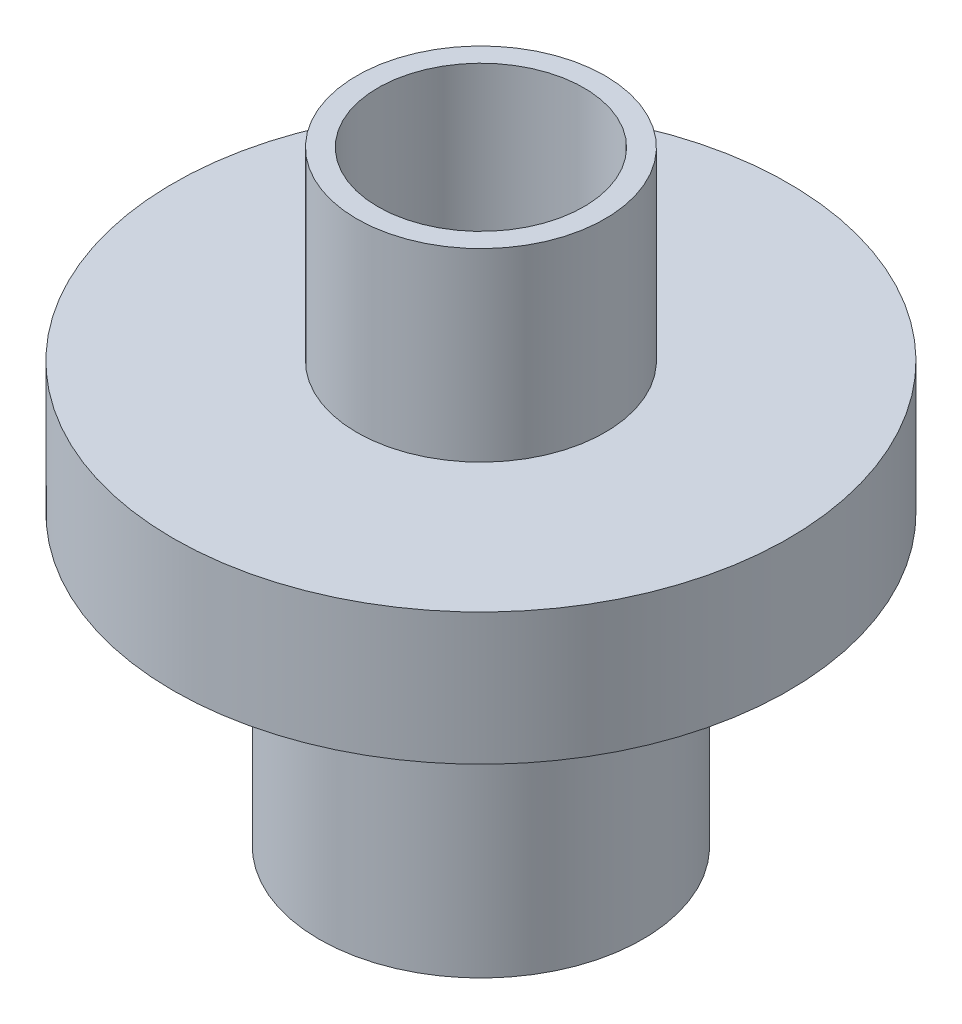
ISO-10303-21;
HEADER;
FILE_DESCRIPTION(('STEP AP214'),'2;1');
FILE_NAME('part.step','',(''),(''),'','','');
FILE_SCHEMA(('AUTOMOTIVE_DESIGN { 1 0 10303 214 1 1 1 1 }'));
ENDSEC;
DATA;
#1=APPLICATION_CONTEXT('core data for automotive mechanical design processes');
#2=APPLICATION_PROTOCOL_DEFINITION('international standard','automotive_design',2000,#1);
#3=PRODUCT_CONTEXT('',#1,'mechanical');
#4=PRODUCT('Part','Part','',(#3));
#5=PRODUCT_RELATED_PRODUCT_CATEGORY('part','',(#4));
#6=PRODUCT_DEFINITION_FORMATION('','',#4);
#7=PRODUCT_DEFINITION_CONTEXT('part definition',#1,'design');
#8=PRODUCT_DEFINITION('design','',#6,#7);
#9=PRODUCT_DEFINITION_SHAPE('','',#8);
#10=(LENGTH_UNIT() NAMED_UNIT(*) SI_UNIT(.MILLI.,.METRE.));
#11=(NAMED_UNIT(*) PLANE_ANGLE_UNIT() SI_UNIT($,.RADIAN.));
#12=(NAMED_UNIT(*) SI_UNIT($,.STERADIAN.) SOLID_ANGLE_UNIT());
#13=UNCERTAINTY_MEASURE_WITH_UNIT(LENGTH_MEASURE(1.E-05),#10,'distance_accuracy_value','');
#14=(GEOMETRIC_REPRESENTATION_CONTEXT(3) GLOBAL_UNCERTAINTY_ASSIGNED_CONTEXT((#13)) GLOBAL_UNIT_ASSIGNED_CONTEXT((#10,
#11,#12)) REPRESENTATION_CONTEXT('',''));
#15=CARTESIAN_POINT('',(0.,0.,0.));
#16=DIRECTION('',(0.,0.,1.));
#17=DIRECTION('',(1.,0.,0.));
#18=AXIS2_PLACEMENT_3D('',#15,#16,#17);
#19=CARTESIAN_POINT('',(-8.9662,0.,0.));
#20=DIRECTION('',(0.,1.,0.));
#21=DIRECTION('',(0.,0.,1.));
#22=AXIS2_PLACEMENT_3D('',#19,#20,#21);
#23=PLANE('',#22);
#24=CARTESIAN_POINT('',(0.,0.,0.));
#25=DIRECTION('',(0.,1.,0.));
#26=DIRECTION('',(0.,0.,1.));
#27=AXIS2_PLACEMENT_3D('',#24,#25,#26);
#28=CIRCLE('',#27,8.9662);
#29=CARTESIAN_POINT('',(0.,0.,8.9662));
#30=VERTEX_POINT('',#29);
#31=EDGE_CURVE('E80',#30,#30,#28,.T.);
#32=ORIENTED_EDGE('',*,*,#31,.T.);
#33=EDGE_LOOP('',(#32));
#34=FACE_BOUND('',#33,.T.);
#35=CARTESIAN_POINT('',(0.,0.,0.));
#36=DIRECTION('',(0.,1.,0.));
#37=DIRECTION('',(0.,0.,1.));
#38=AXIS2_PLACEMENT_3D('',#35,#36,#37);
#39=CIRCLE('',#38,7.4422);
#40=CARTESIAN_POINT('',(0.,0.,7.4422));
#41=VERTEX_POINT('',#40);
#42=EDGE_CURVE('E10',#41,#41,#39,.T.);
#43=ORIENTED_EDGE('',*,*,#42,.F.);
#44=EDGE_LOOP('',(#43));
#45=FACE_BOUND('',#44,.T.);
#46=ADVANCED_FACE('F37',(#34,#45),#23,.T.);
#47=CARTESIAN_POINT('',(0.,0.,0.));
#48=DIRECTION('',(0.,1.,0.));
#49=DIRECTION('',(0.,0.,1.));
#50=AXIS2_PLACEMENT_3D('',#47,#48,#49);
#51=CYLINDRICAL_SURFACE('',#50,7.4422);
#52=ORIENTED_EDGE('',*,*,#42,.T.);
#53=EDGE_LOOP('',(#52));
#54=FACE_BOUND('',#53,.T.);
#55=CARTESIAN_POINT('',(0.,-19.7104,0.));
#56=DIRECTION('',(0.,1.,0.));
#57=DIRECTION('',(0.,0.,1.));
#58=AXIS2_PLACEMENT_3D('',#55,#56,#57);
#59=CIRCLE('',#58,7.4422);
#60=CARTESIAN_POINT('',(0.,-19.7104,7.4422));
#61=VERTEX_POINT('',#60);
#62=EDGE_CURVE('E44',#61,#61,#59,.T.);
#63=ORIENTED_EDGE('',*,*,#62,.F.);
#64=EDGE_LOOP('',(#63));
#65=FACE_BOUND('',#64,.T.);
#66=ADVANCED_FACE('F99',(#54,#65),#51,.F.);
#67=CARTESIAN_POINT('',(-7.4422,-19.7104,0.));
#68=DIRECTION('',(0.,-1.,0.));
#69=DIRECTION('',(0.,0.,-1.));
#70=AXIS2_PLACEMENT_3D('',#67,#68,#69);
#71=PLANE('',#70);
#72=ORIENTED_EDGE('',*,*,#62,.T.);
#73=EDGE_LOOP('',(#72));
#74=FACE_BOUND('',#73,.T.);
#75=CARTESIAN_POINT('',(0.,-19.7104,0.));
#76=DIRECTION('',(0.,1.,0.));
#77=DIRECTION('',(0.,0.,1.));
#78=AXIS2_PLACEMENT_3D('',#75,#76,#77);
#79=CIRCLE('',#78,10.2108);
#80=CARTESIAN_POINT('',(0.,-19.7104,10.2108));
#81=VERTEX_POINT('',#80);
#82=EDGE_CURVE('E49',#81,#81,#79,.T.);
#83=ORIENTED_EDGE('',*,*,#82,.F.);
#84=EDGE_LOOP('',(#83));
#85=FACE_BOUND('',#84,.T.);
#86=ADVANCED_FACE('F103',(#74,#85),#71,.T.);
#87=CARTESIAN_POINT('',(0.,0.,0.));
#88=DIRECTION('',(0.,1.,0.));
#89=DIRECTION('',(0.,0.,1.));
#90=AXIS2_PLACEMENT_3D('',#87,#88,#89);
#91=CYLINDRICAL_SURFACE('',#90,10.2108);
#92=ORIENTED_EDGE('',*,*,#82,.T.);
#93=EDGE_LOOP('',(#92));
#94=FACE_BOUND('',#93,.T.);
#95=CARTESIAN_POINT('',(0.,-43.7134,0.));
#96=DIRECTION('',(0.,1.,0.));
#97=DIRECTION('',(0.,0.,1.));
#98=AXIS2_PLACEMENT_3D('',#95,#96,#97);
#99=CIRCLE('',#98,10.2108);
#100=CARTESIAN_POINT('',(0.,-43.7134,10.2108));
#101=VERTEX_POINT('',#100);
#102=EDGE_CURVE('E54',#101,#101,#99,.T.);
#103=ORIENTED_EDGE('',*,*,#102,.F.);
#104=EDGE_LOOP('',(#103));
#105=FACE_BOUND('',#104,.T.);
#106=ADVANCED_FACE('F107',(#94,#105),#91,.F.);
#107=CARTESIAN_POINT('',(-10.2108,-43.7134,0.));
#108=DIRECTION('',(0.,-1.,0.));
#109=DIRECTION('',(0.,0.,-1.));
#110=AXIS2_PLACEMENT_3D('',#107,#108,#109);
#111=PLANE('',#110);
#112=ORIENTED_EDGE('',*,*,#102,.T.);
#113=EDGE_LOOP('',(#112));
#114=FACE_BOUND('',#113,.T.);
#115=CARTESIAN_POINT('',(0.,-43.7134,0.));
#116=DIRECTION('',(0.,1.,0.));
#117=DIRECTION('',(0.,0.,1.));
#118=AXIS2_PLACEMENT_3D('',#115,#116,#117);
#119=CIRCLE('',#118,11.684);
#120=CARTESIAN_POINT('',(0.,-43.7134,11.684));
#121=VERTEX_POINT('',#120);
#122=EDGE_CURVE('E60',#121,#121,#119,.T.);
#123=ORIENTED_EDGE('',*,*,#122,.F.);
#124=EDGE_LOOP('',(#123));
#125=FACE_BOUND('',#124,.T.);
#126=ADVANCED_FACE('F113',(#114,#125),#111,.T.);
#127=CARTESIAN_POINT('',(0.,0.,0.));
#128=DIRECTION('',(0.,1.,0.));
#129=DIRECTION('',(0.,0.,1.));
#130=AXIS2_PLACEMENT_3D('',#127,#128,#129);
#131=CYLINDRICAL_SURFACE('',#130,11.684);
#132=ORIENTED_EDGE('',*,*,#122,.T.);
#133=EDGE_LOOP('',(#132));
#134=FACE_BOUND('',#133,.T.);
#135=CARTESIAN_POINT('',(0.,-22.8854,0.));
#136=DIRECTION('',(0.,1.,0.));
#137=DIRECTION('',(0.,0.,1.));
#138=AXIS2_PLACEMENT_3D('',#135,#136,#137);
#139=CIRCLE('',#138,11.684);
#140=CARTESIAN_POINT('',(0.,-22.8854,11.684));
#141=VERTEX_POINT('',#140);
#142=EDGE_CURVE('E64',#141,#141,#139,.T.);
#143=ORIENTED_EDGE('',*,*,#142,.F.);
#144=EDGE_LOOP('',(#143));
#145=FACE_BOUND('',#144,.T.);
#146=ADVANCED_FACE('F117',(#134,#145),#131,.T.);
#147=CARTESIAN_POINT('',(-11.684,-22.8854,0.));
#148=DIRECTION('',(0.,-1.,0.));
#149=DIRECTION('',(0.,0.,-1.));
#150=AXIS2_PLACEMENT_3D('',#147,#148,#149);
#151=PLANE('',#150);
#152=ORIENTED_EDGE('',*,*,#142,.T.);
#153=EDGE_LOOP('',(#152));
#154=FACE_BOUND('',#153,.T.);
#155=CARTESIAN_POINT('',(0.,-22.8854,0.));
#156=DIRECTION('',(0.,1.,0.));
#157=DIRECTION('',(0.,0.,1.));
#158=AXIS2_PLACEMENT_3D('',#155,#156,#157);
#159=CIRCLE('',#158,22.225);
#160=CARTESIAN_POINT('',(0.,-22.8854,22.225));
#161=VERTEX_POINT('',#160);
#162=EDGE_CURVE('E68',#161,#161,#159,.T.);
#163=ORIENTED_EDGE('',*,*,#162,.F.);
#164=EDGE_LOOP('',(#163));
#165=FACE_BOUND('',#164,.T.);
#166=ADVANCED_FACE('F121',(#154,#165),#151,.T.);
#167=CARTESIAN_POINT('',(0.,0.,0.));
#168=DIRECTION('',(0.,1.,0.));
#169=DIRECTION('',(0.,0.,1.));
#170=AXIS2_PLACEMENT_3D('',#167,#168,#169);
#171=CYLINDRICAL_SURFACE('',#170,22.225);
#172=ORIENTED_EDGE('',*,*,#162,.T.);
#173=EDGE_LOOP('',(#172));
#174=FACE_BOUND('',#173,.T.);
#175=CARTESIAN_POINT('',(0.,-13.3604,0.));
#176=DIRECTION('',(0.,1.,0.));
#177=DIRECTION('',(0.,0.,1.));
#178=AXIS2_PLACEMENT_3D('',#175,#176,#177);
#179=CIRCLE('',#178,22.225);
#180=CARTESIAN_POINT('',(0.,-13.3604,22.225));
#181=VERTEX_POINT('',#180);
#182=EDGE_CURVE('E72',#181,#181,#179,.T.);
#183=ORIENTED_EDGE('',*,*,#182,.F.);
#184=EDGE_LOOP('',(#183));
#185=FACE_BOUND('',#184,.T.);
#186=ADVANCED_FACE('F95',(#174,#185),#171,.T.);
#187=CARTESIAN_POINT('',(-22.225,-13.3604,0.));
#188=DIRECTION('',(0.,1.,0.));
#189=DIRECTION('',(0.,0.,1.));
#190=AXIS2_PLACEMENT_3D('',#187,#188,#189);
#191=PLANE('',#190);
#192=ORIENTED_EDGE('',*,*,#182,.T.);
#193=EDGE_LOOP('',(#192));
#194=FACE_BOUND('',#193,.T.);
#195=CARTESIAN_POINT('',(0.,-13.3604,0.));
#196=DIRECTION('',(0.,1.,0.));
#197=DIRECTION('',(0.,0.,1.));
#198=AXIS2_PLACEMENT_3D('',#195,#196,#197);
#199=CIRCLE('',#198,8.9662);
#200=CARTESIAN_POINT('',(0.,-13.3604,8.9662));
#201=VERTEX_POINT('',#200);
#202=EDGE_CURVE('E76',#201,#201,#199,.T.);
#203=ORIENTED_EDGE('',*,*,#202,.F.);
#204=EDGE_LOOP('',(#203));
#205=FACE_BOUND('',#204,.T.);
#206=ADVANCED_FACE('F89',(#194,#205),#191,.T.);
#207=CARTESIAN_POINT('',(0.,0.,0.));
#208=DIRECTION('',(0.,1.,0.));
#209=DIRECTION('',(0.,0.,1.));
#210=AXIS2_PLACEMENT_3D('',#207,#208,#209);
#211=CYLINDRICAL_SURFACE('',#210,8.9662);
#212=ORIENTED_EDGE('',*,*,#202,.T.);
#213=EDGE_LOOP('',(#212));
#214=FACE_BOUND('',#213,.T.);
#215=ORIENTED_EDGE('',*,*,#31,.F.);
#216=EDGE_LOOP('',(#215));
#217=FACE_BOUND('',#216,.T.);
#218=ADVANCED_FACE('F87',(#214,#217),#211,.T.);
#219=CLOSED_SHELL('',(#46,#66,#86,#106,#126,#146,#166,#186,#206,#218));
#220=MANIFOLD_SOLID_BREP('B2',#219);
#221=ADVANCED_BREP_SHAPE_REPRESENTATION('',(#18,#220),#14);
#222=SHAPE_DEFINITION_REPRESENTATION(#9,#221);
ENDSEC;
END-ISO-10303-21;
